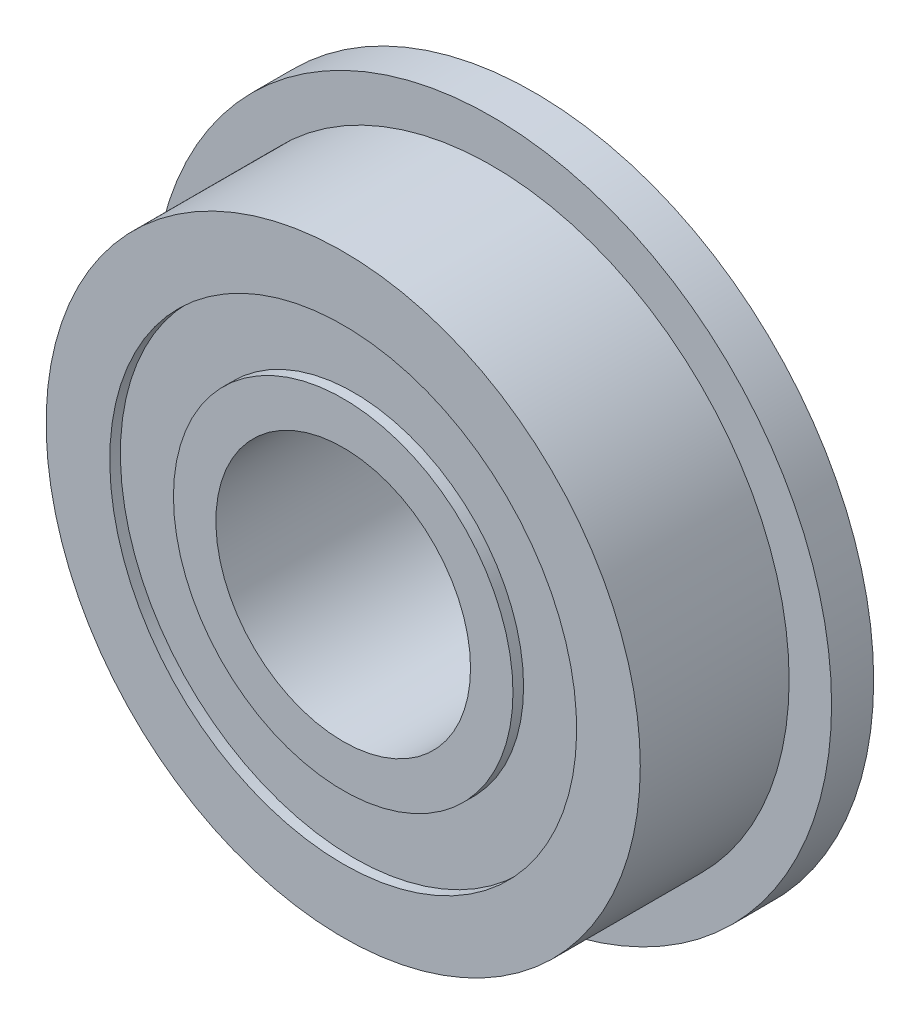
ISO-10303-21;
HEADER;
FILE_DESCRIPTION(('STEP AP214'),'2;1');
FILE_NAME('part.step','',(''),(''),'','','');
FILE_SCHEMA(('AUTOMOTIVE_DESIGN { 1 0 10303 214 1 1 1 1 }'));
ENDSEC;
DATA;
#1=APPLICATION_CONTEXT('core data for automotive mechanical design processes');
#2=APPLICATION_PROTOCOL_DEFINITION('international standard','automotive_design',2000,#1);
#3=PRODUCT_CONTEXT('',#1,'mechanical');
#4=PRODUCT('Part','Part','',(#3));
#5=PRODUCT_RELATED_PRODUCT_CATEGORY('part','',(#4));
#6=PRODUCT_DEFINITION_FORMATION('','',#4);
#7=PRODUCT_DEFINITION_CONTEXT('part definition',#1,'design');
#8=PRODUCT_DEFINITION('design','',#6,#7);
#9=PRODUCT_DEFINITION_SHAPE('','',#8);
#10=(LENGTH_UNIT() NAMED_UNIT(*) SI_UNIT(.MILLI.,.METRE.));
#11=(NAMED_UNIT(*) PLANE_ANGLE_UNIT() SI_UNIT($,.RADIAN.));
#12=(NAMED_UNIT(*) SI_UNIT($,.STERADIAN.) SOLID_ANGLE_UNIT());
#13=UNCERTAINTY_MEASURE_WITH_UNIT(LENGTH_MEASURE(1.E-05),#10,'distance_accuracy_value','');
#14=(GEOMETRIC_REPRESENTATION_CONTEXT(3) GLOBAL_UNCERTAINTY_ASSIGNED_CONTEXT((#13)) GLOBAL_UNIT_ASSIGNED_CONTEXT((#10,
#11,#12)) REPRESENTATION_CONTEXT('',''));
#15=CARTESIAN_POINT('',(0.,0.,0.));
#16=DIRECTION('',(0.,0.,1.));
#17=DIRECTION('',(1.,0.,0.));
#18=AXIS2_PLACEMENT_3D('',#15,#16,#17);
#19=CARTESIAN_POINT('',(0.,0.,-3.57124));
#20=DIRECTION('',(0.,0.,-1.));
#21=DIRECTION('',(0.,-1.,0.));
#22=AXIS2_PLACEMENT_3D('',#19,#20,#21);
#23=CYLINDRICAL_SURFACE('',#22,6.35);
#24=CARTESIAN_POINT('',(0.,0.,-3.174365));
#25=DIRECTION('',(0.,0.,1.));
#26=DIRECTION('',(1.,0.,0.));
#27=AXIS2_PLACEMENT_3D('',#24,#25,#26);
#28=CIRCLE('',#27,6.35);
#29=CARTESIAN_POINT('',(6.35,0.,-3.174365));
#30=VERTEX_POINT('',#29);
#31=EDGE_CURVE('E21',#30,#30,#28,.T.);
#32=ORIENTED_EDGE('',*,*,#31,.F.);
#33=EDGE_LOOP('',(#32));
#34=FACE_BOUND('',#33,.T.);
#35=CARTESIAN_POINT('',(0.,0.,-3.57124));
#36=DIRECTION('',(0.,0.,-1.));
#37=DIRECTION('',(0.,-1.,0.));
#38=AXIS2_PLACEMENT_3D('',#35,#36,#37);
#39=CIRCLE('',#38,6.35);
#40=CARTESIAN_POINT('',(0.,-6.35,-3.57124));
#41=VERTEX_POINT('',#40);
#42=EDGE_CURVE('E30',#41,#41,#39,.T.);
#43=ORIENTED_EDGE('',*,*,#42,.F.);
#44=EDGE_LOOP('',(#43));
#45=FACE_BOUND('',#44,.T.);
#46=ADVANCED_FACE('F13',(#34,#45),#23,.T.);
#47=CARTESIAN_POINT('',(0.,0.,-3.57124));
#48=DIRECTION('',(0.,0.,-1.));
#49=DIRECTION('',(0.,-1.,0.));
#50=AXIS2_PLACEMENT_3D('',#47,#48,#49);
#51=CYLINDRICAL_SURFACE('',#50,8.73125);
#52=CARTESIAN_POINT('',(0.,0.,-3.174365));
#53=DIRECTION('',(0.,0.,1.));
#54=DIRECTION('',(1.,0.,0.));
#55=AXIS2_PLACEMENT_3D('',#52,#53,#54);
#56=CIRCLE('',#55,8.73125);
#57=CARTESIAN_POINT('',(8.73125,0.,-3.174365));
#58=VERTEX_POINT('',#57);
#59=EDGE_CURVE('E8',#58,#58,#56,.T.);
#60=ORIENTED_EDGE('',*,*,#59,.T.);
#61=EDGE_LOOP('',(#60));
#62=FACE_BOUND('',#61,.T.);
#63=CARTESIAN_POINT('',(0.,0.,-3.57124));
#64=DIRECTION('',(0.,0.,1.));
#65=DIRECTION('',(1.,0.,0.));
#66=AXIS2_PLACEMENT_3D('',#63,#64,#65);
#67=CIRCLE('',#66,8.73125);
#68=CARTESIAN_POINT('',(8.73125,0.,-3.57124));
#69=VERTEX_POINT('',#68);
#70=EDGE_CURVE('E26',#69,#69,#67,.T.);
#71=ORIENTED_EDGE('',*,*,#70,.F.);
#72=EDGE_LOOP('',(#71));
#73=FACE_BOUND('',#72,.T.);
#74=ADVANCED_FACE('F66',(#62,#73),#51,.F.);
#75=CARTESIAN_POINT('',(0.,0.,-3.174365));
#76=DIRECTION('',(0.,0.,1.));
#77=DIRECTION('',(1.,0.,0.));
#78=AXIS2_PLACEMENT_3D('',#75,#76,#77);
#79=PLANE('',#78);
#80=ORIENTED_EDGE('',*,*,#31,.T.);
#81=EDGE_LOOP('',(#80));
#82=FACE_BOUND('',#81,.T.);
#83=ORIENTED_EDGE('',*,*,#59,.F.);
#84=EDGE_LOOP('',(#83));
#85=FACE_BOUND('',#84,.T.);
#86=ADVANCED_FACE('F73',(#82,#85),#79,.F.);
#87=CARTESIAN_POINT('',(0.,0.,-3.57124));
#88=DIRECTION('',(0.,0.,-1.));
#89=DIRECTION('',(-1.,0.,0.));
#90=AXIS2_PLACEMENT_3D('',#87,#88,#89);
#91=PLANE('',#90);
#92=CARTESIAN_POINT('',(0.,0.,-3.57124));
#93=DIRECTION('',(0.,0.,1.));
#94=DIRECTION('',(1.,0.,0.));
#95=AXIS2_PLACEMENT_3D('',#92,#93,#94);
#96=CIRCLE('',#95,12.7);
#97=CARTESIAN_POINT('',(12.7,0.,-3.57124));
#98=VERTEX_POINT('',#97);
#99=EDGE_CURVE('E34',#98,#98,#96,.T.);
#100=ORIENTED_EDGE('',*,*,#99,.F.);
#101=EDGE_LOOP('',(#100));
#102=FACE_BOUND('',#101,.T.);
#103=ORIENTED_EDGE('',*,*,#70,.T.);
#104=EDGE_LOOP('',(#103));
#105=FACE_BOUND('',#104,.T.);
#106=ADVANCED_FACE('F77',(#102,#105),#91,.T.);
#107=CARTESIAN_POINT('',(0.,0.,3.57124));
#108=DIRECTION('',(0.,0.,-1.));
#109=DIRECTION('',(0.,-1.,0.));
#110=AXIS2_PLACEMENT_3D('',#107,#108,#109);
#111=CYLINDRICAL_SURFACE('',#110,6.35);
#112=CARTESIAN_POINT('',(0.,0.,3.174365));
#113=DIRECTION('',(0.,0.,1.));
#114=DIRECTION('',(1.,0.,0.));
#115=AXIS2_PLACEMENT_3D('',#112,#113,#114);
#116=CIRCLE('',#115,6.35);
#117=CARTESIAN_POINT('',(6.35,0.,3.174365));
#118=VERTEX_POINT('',#117);
#119=EDGE_CURVE('E33',#118,#118,#116,.T.);
#120=ORIENTED_EDGE('',*,*,#119,.T.);
#121=EDGE_LOOP('',(#120));
#122=FACE_BOUND('',#121,.T.);
#123=CARTESIAN_POINT('',(0.,0.,3.57124));
#124=DIRECTION('',(0.,0.,1.));
#125=DIRECTION('',(1.,0.,0.));
#126=AXIS2_PLACEMENT_3D('',#123,#124,#125);
#127=CIRCLE('',#126,6.35);
#128=CARTESIAN_POINT('',(6.35,0.,3.57124));
#129=VERTEX_POINT('',#128);
#130=EDGE_CURVE('E38',#129,#129,#127,.T.);
#131=ORIENTED_EDGE('',*,*,#130,.F.);
#132=EDGE_LOOP('',(#131));
#133=FACE_BOUND('',#132,.T.);
#134=ADVANCED_FACE('F80',(#122,#133),#111,.T.);
#135=CARTESIAN_POINT('',(0.,0.,3.57124));
#136=DIRECTION('',(0.,0.,-1.));
#137=DIRECTION('',(0.,-1.,0.));
#138=AXIS2_PLACEMENT_3D('',#135,#136,#137);
#139=CYLINDRICAL_SURFACE('',#138,8.73125);
#140=CARTESIAN_POINT('',(0.,0.,3.174365));
#141=DIRECTION('',(0.,0.,1.));
#142=DIRECTION('',(1.,0.,0.));
#143=AXIS2_PLACEMENT_3D('',#140,#141,#142);
#144=CIRCLE('',#143,8.73125);
#145=CARTESIAN_POINT('',(8.73125,0.,3.174365));
#146=VERTEX_POINT('',#145);
#147=EDGE_CURVE('E41',#146,#146,#144,.T.);
#148=ORIENTED_EDGE('',*,*,#147,.F.);
#149=EDGE_LOOP('',(#148));
#150=FACE_BOUND('',#149,.T.);
#151=CARTESIAN_POINT('',(0.,0.,3.57124));
#152=DIRECTION('',(0.,0.,-1.));
#153=DIRECTION('',(0.,-1.,0.));
#154=AXIS2_PLACEMENT_3D('',#151,#152,#153);
#155=CIRCLE('',#154,8.73125);
#156=CARTESIAN_POINT('',(0.,-8.73125,3.57124));
#157=VERTEX_POINT('',#156);
#158=EDGE_CURVE('E47',#157,#157,#155,.T.);
#159=ORIENTED_EDGE('',*,*,#158,.F.);
#160=EDGE_LOOP('',(#159));
#161=FACE_BOUND('',#160,.T.);
#162=ADVANCED_FACE('F86',(#150,#161),#139,.F.);
#163=CARTESIAN_POINT('',(0.,0.,3.174365));
#164=DIRECTION('',(0.,0.,-1.));
#165=DIRECTION('',(-1.,0.,0.));
#166=AXIS2_PLACEMENT_3D('',#163,#164,#165);
#167=PLANE('',#166);
#168=ORIENTED_EDGE('',*,*,#119,.F.);
#169=EDGE_LOOP('',(#168));
#170=FACE_BOUND('',#169,.T.);
#171=ORIENTED_EDGE('',*,*,#147,.T.);
#172=EDGE_LOOP('',(#171));
#173=FACE_BOUND('',#172,.T.);
#174=ADVANCED_FACE('F82',(#170,#173),#167,.F.);
#175=CARTESIAN_POINT('',(0.,0.,3.57124));
#176=DIRECTION('',(0.,0.,-1.));
#177=DIRECTION('',(-1.,0.,0.));
#178=AXIS2_PLACEMENT_3D('',#175,#176,#177);
#179=PLANE('',#178);
#180=CARTESIAN_POINT('',(0.,0.,3.57124));
#181=DIRECTION('',(0.,0.,1.));
#182=DIRECTION('',(1.,0.,0.));
#183=AXIS2_PLACEMENT_3D('',#180,#181,#182);
#184=CIRCLE('',#183,11.1125);
#185=CARTESIAN_POINT('',(11.1125,0.,3.57124));
#186=VERTEX_POINT('',#185);
#187=EDGE_CURVE('E46',#186,#186,#184,.T.);
#188=ORIENTED_EDGE('',*,*,#187,.T.);
#189=EDGE_LOOP('',(#188));
#190=FACE_BOUND('',#189,.T.);
#191=ORIENTED_EDGE('',*,*,#158,.T.);
#192=EDGE_LOOP('',(#191));
#193=FACE_BOUND('',#192,.T.);
#194=ADVANCED_FACE('F85',(#190,#193),#179,.F.);
#195=CARTESIAN_POINT('',(0.,0.,3.57124));
#196=DIRECTION('',(0.,0.,-1.));
#197=DIRECTION('',(0.,-1.,0.));
#198=AXIS2_PLACEMENT_3D('',#195,#196,#197);
#199=CYLINDRICAL_SURFACE('',#198,11.1125);
#200=CARTESIAN_POINT('',(0.,0.,-1.99644));
#201=DIRECTION('',(0.,0.,1.));
#202=DIRECTION('',(1.,0.,0.));
#203=AXIS2_PLACEMENT_3D('',#200,#201,#202);
#204=CIRCLE('',#203,11.1125);
#205=CARTESIAN_POINT('',(11.1125,0.,-1.99644));
#206=VERTEX_POINT('',#205);
#207=EDGE_CURVE('E50',#206,#206,#204,.T.);
#208=ORIENTED_EDGE('',*,*,#207,.T.);
#209=EDGE_LOOP('',(#208));
#210=FACE_BOUND('',#209,.T.);
#211=ORIENTED_EDGE('',*,*,#187,.F.);
#212=EDGE_LOOP('',(#211));
#213=FACE_BOUND('',#212,.T.);
#214=ADVANCED_FACE('F90',(#210,#213),#199,.T.);
#215=CARTESIAN_POINT('',(0.,0.,-1.99644));
#216=DIRECTION('',(0.,0.,-1.));
#217=DIRECTION('',(-1.,0.,0.));
#218=AXIS2_PLACEMENT_3D('',#215,#216,#217);
#219=PLANE('',#218);
#220=ORIENTED_EDGE('',*,*,#207,.F.);
#221=EDGE_LOOP('',(#220));
#222=FACE_BOUND('',#221,.T.);
#223=CARTESIAN_POINT('',(0.,0.,-1.99644));
#224=DIRECTION('',(0.,0.,-1.));
#225=DIRECTION('',(0.,-1.,0.));
#226=AXIS2_PLACEMENT_3D('',#223,#224,#225);
#227=CIRCLE('',#226,12.7);
#228=CARTESIAN_POINT('',(0.,-12.7,-1.99644));
#229=VERTEX_POINT('',#228);
#230=EDGE_CURVE('E37',#229,#229,#227,.T.);
#231=ORIENTED_EDGE('',*,*,#230,.F.);
#232=EDGE_LOOP('',(#231));
#233=FACE_BOUND('',#232,.T.);
#234=ADVANCED_FACE('F92',(#222,#233),#219,.F.);
#235=CARTESIAN_POINT('',(0.,0.,0.));
#236=DIRECTION('',(0.,0.,1.));
#237=DIRECTION('',(1.,0.,0.));
#238=AXIS2_PLACEMENT_3D('',#235,#236,#237);
#239=CYLINDRICAL_SURFACE('',#238,4.7625);
#240=CARTESIAN_POINT('',(0.,0.,-3.57124));
#241=DIRECTION('',(0.,0.,1.));
#242=DIRECTION('',(1.,0.,0.));
#243=AXIS2_PLACEMENT_3D('',#240,#241,#242);
#244=CIRCLE('',#243,4.7625);
#245=CARTESIAN_POINT('',(4.7625,0.,-3.57124));
#246=VERTEX_POINT('',#245);
#247=EDGE_CURVE('E56',#246,#246,#244,.T.);
#248=ORIENTED_EDGE('',*,*,#247,.F.);
#249=EDGE_LOOP('',(#248));
#250=FACE_BOUND('',#249,.T.);
#251=CARTESIAN_POINT('',(0.,0.,3.57124));
#252=DIRECTION('',(0.,0.,-1.));
#253=DIRECTION('',(0.,-1.,0.));
#254=AXIS2_PLACEMENT_3D('',#251,#252,#253);
#255=CIRCLE('',#254,4.7625);
#256=CARTESIAN_POINT('',(0.,-4.7625,3.57124));
#257=VERTEX_POINT('',#256);
#258=EDGE_CURVE('E17',#257,#257,#255,.T.);
#259=ORIENTED_EDGE('',*,*,#258,.F.);
#260=EDGE_LOOP('',(#259));
#261=FACE_BOUND('',#260,.T.);
#262=ADVANCED_FACE('F95',(#250,#261),#239,.F.);
#263=CARTESIAN_POINT('',(0.,0.,-3.57124));
#264=DIRECTION('',(0.,0.,-1.));
#265=DIRECTION('',(-1.,0.,0.));
#266=AXIS2_PLACEMENT_3D('',#263,#264,#265);
#267=PLANE('',#266);
#268=ORIENTED_EDGE('',*,*,#42,.T.);
#269=EDGE_LOOP('',(#268));
#270=FACE_BOUND('',#269,.T.);
#271=ORIENTED_EDGE('',*,*,#247,.T.);
#272=EDGE_LOOP('',(#271));
#273=FACE_BOUND('',#272,.T.);
#274=ADVANCED_FACE('F63',(#270,#273),#267,.T.);
#275=CARTESIAN_POINT('',(0.,0.,0.));
#276=DIRECTION('',(0.,0.,1.));
#277=DIRECTION('',(1.,0.,0.));
#278=AXIS2_PLACEMENT_3D('',#275,#276,#277);
#279=CYLINDRICAL_SURFACE('',#278,12.7);
#280=ORIENTED_EDGE('',*,*,#230,.T.);
#281=EDGE_LOOP('',(#280));
#282=FACE_BOUND('',#281,.T.);
#283=ORIENTED_EDGE('',*,*,#99,.T.);
#284=EDGE_LOOP('',(#283));
#285=FACE_BOUND('',#284,.T.);
#286=ADVANCED_FACE('F15',(#282,#285),#279,.T.);
#287=CARTESIAN_POINT('',(0.,0.,3.57124));
#288=DIRECTION('',(0.,0.,-1.));
#289=DIRECTION('',(-1.,0.,0.));
#290=AXIS2_PLACEMENT_3D('',#287,#288,#289);
#291=PLANE('',#290);
#292=ORIENTED_EDGE('',*,*,#130,.T.);
#293=EDGE_LOOP('',(#292));
#294=FACE_BOUND('',#293,.T.);
#295=ORIENTED_EDGE('',*,*,#258,.T.);
#296=EDGE_LOOP('',(#295));
#297=FACE_BOUND('',#296,.T.);
#298=ADVANCED_FACE('F99',(#294,#297),#291,.F.);
#299=CLOSED_SHELL('',(#46,#74,#86,#106,#134,#162,#174,#194,#214,#234,#262,#274,#286,#298));
#300=MANIFOLD_SOLID_BREP('B1',#299);
#301=ADVANCED_BREP_SHAPE_REPRESENTATION('',(#18,#300),#14);
#302=SHAPE_DEFINITION_REPRESENTATION(#9,#301);
ENDSEC;
END-ISO-10303-21;
